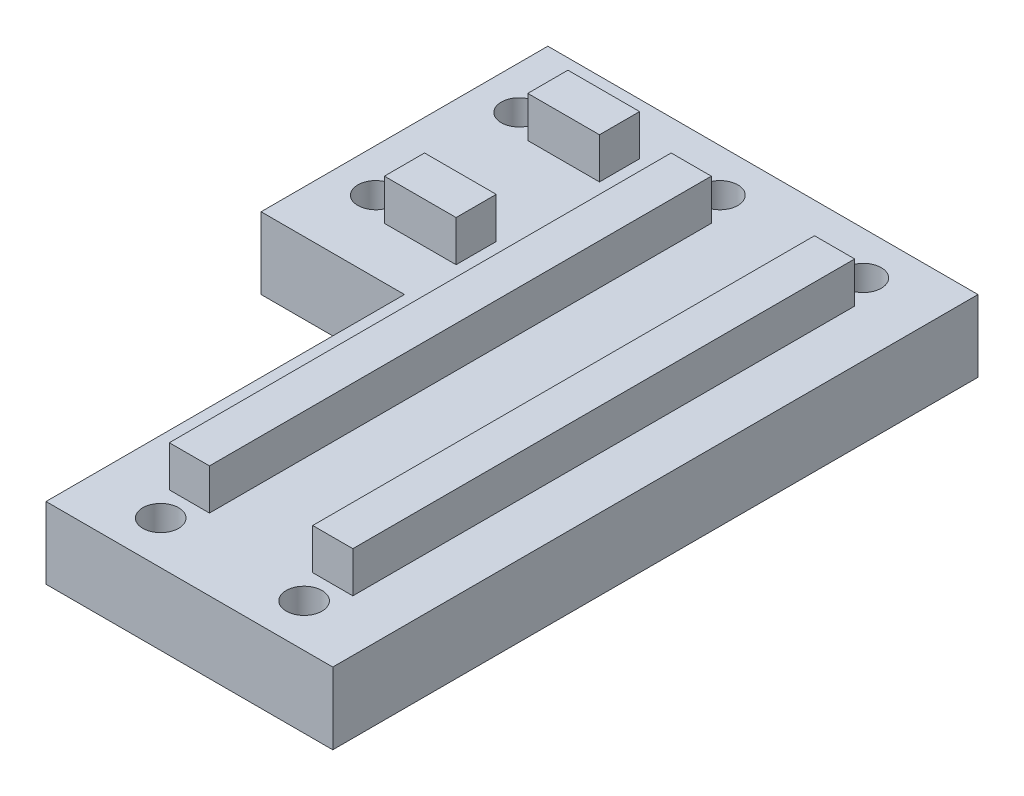
ISO-10303-21;
HEADER;
FILE_DESCRIPTION(('STEP AP214'),'2;1');
FILE_NAME('part.step','',(''),(''),'','','');
FILE_SCHEMA(('AUTOMOTIVE_DESIGN { 1 0 10303 214 1 1 1 1 }'));
ENDSEC;
DATA;
#1=APPLICATION_CONTEXT('core data for automotive mechanical design processes');
#2=APPLICATION_PROTOCOL_DEFINITION('international standard','automotive_design',2000,#1);
#3=PRODUCT_CONTEXT('',#1,'mechanical');
#4=PRODUCT('Part','Part','',(#3));
#5=PRODUCT_RELATED_PRODUCT_CATEGORY('part','',(#4));
#6=PRODUCT_DEFINITION_FORMATION('','',#4);
#7=PRODUCT_DEFINITION_CONTEXT('part definition',#1,'design');
#8=PRODUCT_DEFINITION('design','',#6,#7);
#9=PRODUCT_DEFINITION_SHAPE('','',#8);
#10=(LENGTH_UNIT() NAMED_UNIT(*) SI_UNIT(.MILLI.,.METRE.));
#11=(NAMED_UNIT(*) PLANE_ANGLE_UNIT() SI_UNIT($,.RADIAN.));
#12=(NAMED_UNIT(*) SI_UNIT($,.STERADIAN.) SOLID_ANGLE_UNIT());
#13=UNCERTAINTY_MEASURE_WITH_UNIT(LENGTH_MEASURE(1.E-05),#10,'distance_accuracy_value','');
#14=(GEOMETRIC_REPRESENTATION_CONTEXT(3) GLOBAL_UNCERTAINTY_ASSIGNED_CONTEXT((#13)) GLOBAL_UNIT_ASSIGNED_CONTEXT((#10,
#11,#12)) REPRESENTATION_CONTEXT('',''));
#15=CARTESIAN_POINT('',(0.,0.,0.));
#16=DIRECTION('',(0.,0.,1.));
#17=DIRECTION('',(1.,0.,0.));
#18=AXIS2_PLACEMENT_3D('',#15,#16,#17);
#19=CARTESIAN_POINT('',(-15.,10.,20.));
#20=DIRECTION('',(0.,0.,-1.));
#21=DIRECTION('',(-1.,0.,0.));
#22=AXIS2_PLACEMENT_3D('',#19,#20,#21);
#23=PLANE('',#22);
#24=DIRECTION('',(0.,1.,0.));
#25=VECTOR('',#24,1.);
#26=CARTESIAN_POINT('',(-35.,10.,20.));
#27=LINE('',#26,#25);
#28=CARTESIAN_POINT('',(-35.,0.,20.));
#29=VERTEX_POINT('',#28);
#30=CARTESIAN_POINT('',(-35.,10.,20.));
#31=VERTEX_POINT('',#30);
#32=EDGE_CURVE('E331',#29,#31,#27,.T.);
#33=ORIENTED_EDGE('',*,*,#32,.F.);
#34=DIRECTION('',(1.,0.,0.));
#35=VECTOR('',#34,1.);
#36=CARTESIAN_POINT('',(-15.,0.,20.));
#37=LINE('',#36,#35);
#38=CARTESIAN_POINT('',(-15.,0.,20.));
#39=VERTEX_POINT('',#38);
#40=EDGE_CURVE('E234',#29,#39,#37,.T.);
#41=ORIENTED_EDGE('',*,*,#40,.T.);
#42=DIRECTION('',(0.,-1.,0.));
#43=VECTOR('',#42,1.);
#44=CARTESIAN_POINT('',(-15.,10.,20.));
#45=LINE('',#44,#43);
#46=CARTESIAN_POINT('',(-15.,10.,20.));
#47=VERTEX_POINT('',#46);
#48=EDGE_CURVE('E267',#47,#39,#45,.T.);
#49=ORIENTED_EDGE('',*,*,#48,.F.);
#50=DIRECTION('',(1.,0.,0.));
#51=VECTOR('',#50,1.);
#52=CARTESIAN_POINT('',(-15.,10.,20.));
#53=LINE('',#52,#51);
#54=EDGE_CURVE('E237',#31,#47,#53,.T.);
#55=ORIENTED_EDGE('',*,*,#54,.F.);
#56=EDGE_LOOP('',(#33,#41,#49,#55));
#57=FACE_BOUND('',#56,.T.);
#58=ADVANCED_FACE('F34',(#57),#23,.F.);
#59=CARTESIAN_POINT('',(25.,10.,-20.));
#60=DIRECTION('',(0.,0.,1.));
#61=DIRECTION('',(1.,0.,0.));
#62=AXIS2_PLACEMENT_3D('',#59,#60,#61);
#63=PLANE('',#62);
#64=DIRECTION('',(0.,-1.,0.));
#65=VECTOR('',#64,1.);
#66=CARTESIAN_POINT('',(-35.,10.,-20.));
#67=LINE('',#66,#65);
#68=CARTESIAN_POINT('',(-35.,10.,-20.));
#69=VERTEX_POINT('',#68);
#70=CARTESIAN_POINT('',(-35.,0.,-20.));
#71=VERTEX_POINT('',#70);
#72=EDGE_CURVE('E326',#69,#71,#67,.T.);
#73=ORIENTED_EDGE('',*,*,#72,.F.);
#74=DIRECTION('',(-1.,0.,0.));
#75=VECTOR('',#74,1.);
#76=CARTESIAN_POINT('',(25.,10.,-20.));
#77=LINE('',#76,#75);
#78=CARTESIAN_POINT('',(25.,10.,-20.));
#79=VERTEX_POINT('',#78);
#80=EDGE_CURVE('E246',#79,#69,#77,.T.);
#81=ORIENTED_EDGE('',*,*,#80,.F.);
#82=DIRECTION('',(0.,-1.,0.));
#83=VECTOR('',#82,1.);
#84=CARTESIAN_POINT('',(25.,10.,-20.));
#85=LINE('',#84,#83);
#86=CARTESIAN_POINT('',(25.,0.,-20.));
#87=VERTEX_POINT('',#86);
#88=EDGE_CURVE('E248',#79,#87,#85,.T.);
#89=ORIENTED_EDGE('',*,*,#88,.T.);
#90=DIRECTION('',(-1.,0.,0.));
#91=VECTOR('',#90,1.);
#92=CARTESIAN_POINT('',(25.,0.,-20.));
#93=LINE('',#92,#91);
#94=EDGE_CURVE('E240',#87,#71,#93,.T.);
#95=ORIENTED_EDGE('',*,*,#94,.T.);
#96=EDGE_LOOP('',(#73,#81,#89,#95));
#97=FACE_BOUND('',#96,.T.);
#98=ADVANCED_FACE('F389',(#97),#63,.F.);
#99=CARTESIAN_POINT('',(0.,0.,0.));
#100=DIRECTION('',(0.,-1.,0.));
#101=DIRECTION('',(0.,0.,-1.));
#102=AXIS2_PLACEMENT_3D('',#99,#100,#101);
#103=PLANE('',#102);
#104=CARTESIAN_POINT('',(-5.,0.,64.));
#105=DIRECTION('',(0.,1.,0.));
#106=DIRECTION('',(0.,0.,1.));
#107=AXIS2_PLACEMENT_3D('',#104,#105,#106);
#108=CIRCLE('',#107,2.5);
#109=CARTESIAN_POINT('',(-5.,0.,66.5));
#110=VERTEX_POINT('',#109);
#111=EDGE_CURVE('E501',#110,#110,#108,.T.);
#112=ORIENTED_EDGE('',*,*,#111,.T.);
#113=EDGE_LOOP('',(#112));
#114=FACE_BOUND('',#113,.T.);
#115=CARTESIAN_POINT('',(-4.99999999999999,0.,-14.));
#116=DIRECTION('',(0.,1.,0.));
#117=DIRECTION('',(0.,0.,1.));
#118=AXIS2_PLACEMENT_3D('',#115,#116,#117);
#119=CIRCLE('',#118,2.5);
#120=CARTESIAN_POINT('',(-4.99999999999999,0.,-11.5));
#121=VERTEX_POINT('',#120);
#122=EDGE_CURVE('E490',#121,#121,#119,.T.);
#123=ORIENTED_EDGE('',*,*,#122,.T.);
#124=EDGE_LOOP('',(#123));
#125=FACE_BOUND('',#124,.T.);
#126=CARTESIAN_POINT('',(15.,0.,-14.));
#127=DIRECTION('',(0.,1.,0.));
#128=DIRECTION('',(0.,0.,1.));
#129=AXIS2_PLACEMENT_3D('',#126,#127,#128);
#130=CIRCLE('',#129,2.5);
#131=CARTESIAN_POINT('',(15.,0.,-11.5));
#132=VERTEX_POINT('',#131);
#133=EDGE_CURVE('E489',#132,#132,#130,.T.);
#134=ORIENTED_EDGE('',*,*,#133,.T.);
#135=EDGE_LOOP('',(#134));
#136=FACE_BOUND('',#135,.T.);
#137=CARTESIAN_POINT('',(-29.,0.,9.99999999999999));
#138=DIRECTION('',(0.,1.,0.));
#139=DIRECTION('',(0.,0.,1.));
#140=AXIS2_PLACEMENT_3D('',#137,#138,#139);
#141=CIRCLE('',#140,2.5);
#142=CARTESIAN_POINT('',(-29.,0.,12.5));
#143=VERTEX_POINT('',#142);
#144=EDGE_CURVE('E483',#143,#143,#141,.T.);
#145=ORIENTED_EDGE('',*,*,#144,.T.);
#146=EDGE_LOOP('',(#145));
#147=FACE_BOUND('',#146,.T.);
#148=CARTESIAN_POINT('',(15.,0.,64.));
#149=DIRECTION('',(0.,1.,0.));
#150=DIRECTION('',(0.,0.,1.));
#151=AXIS2_PLACEMENT_3D('',#148,#149,#150);
#152=CIRCLE('',#151,2.5);
#153=CARTESIAN_POINT('',(15.,0.,66.5));
#154=VERTEX_POINT('',#153);
#155=EDGE_CURVE('E502',#154,#154,#152,.T.);
#156=ORIENTED_EDGE('',*,*,#155,.T.);
#157=EDGE_LOOP('',(#156));
#158=FACE_BOUND('',#157,.T.);
#159=CARTESIAN_POINT('',(-29.,0.,-10.));
#160=DIRECTION('',(0.,1.,0.));
#161=DIRECTION('',(0.,0.,1.));
#162=AXIS2_PLACEMENT_3D('',#159,#160,#161);
#163=CIRCLE('',#162,2.5);
#164=CARTESIAN_POINT('',(-29.,0.,-7.50000000000001));
#165=VERTEX_POINT('',#164);
#166=EDGE_CURVE('E306',#165,#165,#163,.T.);
#167=ORIENTED_EDGE('',*,*,#166,.T.);
#168=EDGE_LOOP('',(#167));
#169=FACE_BOUND('',#168,.T.);
#170=ORIENTED_EDGE('',*,*,#40,.F.);
#171=DIRECTION('',(0.,0.,-1.));
#172=VECTOR('',#171,1.);
#173=CARTESIAN_POINT('',(-35.,0.,0.));
#174=LINE('',#173,#172);
#175=EDGE_CURVE('E328',#29,#71,#174,.T.);
#176=ORIENTED_EDGE('',*,*,#175,.T.);
#177=ORIENTED_EDGE('',*,*,#94,.F.);
#178=DIRECTION('',(0.,0.,-1.));
#179=VECTOR('',#178,1.);
#180=CARTESIAN_POINT('',(25.,0.,-20.));
#181=LINE('',#180,#179);
#182=CARTESIAN_POINT('',(25.,0.,70.));
#183=VERTEX_POINT('',#182);
#184=EDGE_CURVE('E255',#183,#87,#181,.T.);
#185=ORIENTED_EDGE('',*,*,#184,.F.);
#186=DIRECTION('',(1.,0.,0.));
#187=VECTOR('',#186,1.);
#188=CARTESIAN_POINT('',(25.,0.,70.));
#189=LINE('',#188,#187);
#190=CARTESIAN_POINT('',(-15.,0.,70.));
#191=VERTEX_POINT('',#190);
#192=EDGE_CURVE('E252',#191,#183,#189,.T.);
#193=ORIENTED_EDGE('',*,*,#192,.F.);
#194=DIRECTION('',(0.,0.,1.));
#195=VECTOR('',#194,1.);
#196=CARTESIAN_POINT('',(-15.,0.,20.));
#197=LINE('',#196,#195);
#198=EDGE_CURVE('E250',#39,#191,#197,.T.);
#199=ORIENTED_EDGE('',*,*,#198,.F.);
#200=EDGE_LOOP('',(#170,#176,#177,#185,#193,#199));
#201=FACE_BOUND('',#200,.T.);
#202=ADVANCED_FACE('F394',(#114,#125,#136,#147,#158,#169,#201),#103,.T.);
#203=CARTESIAN_POINT('',(-15.,10.,7.19999999999998));
#204=DIRECTION('',(0.,0.,-1.));
#205=DIRECTION('',(-1.,0.,0.));
#206=AXIS2_PLACEMENT_3D('',#203,#204,#205);
#207=PLANE('',#206);
#208=DIRECTION('',(0.,-1.,0.));
#209=VECTOR('',#208,1.);
#210=CARTESIAN_POINT('',(-25.,10.,7.19999999999998));
#211=LINE('',#210,#209);
#212=CARTESIAN_POINT('',(-25.,15.6999999999998,7.19999999999998));
#213=VERTEX_POINT('',#212);
#214=CARTESIAN_POINT('',(-25.,10.,7.19999999999998));
#215=VERTEX_POINT('',#214);
#216=EDGE_CURVE('E191',#213,#215,#211,.T.);
#217=ORIENTED_EDGE('',*,*,#216,.F.);
#218=DIRECTION('',(-1.,0.,0.));
#219=VECTOR('',#218,1.);
#220=CARTESIAN_POINT('',(-15.,15.6999999999998,7.19999999999998));
#221=LINE('',#220,#219);
#222=CARTESIAN_POINT('',(-15.,15.6999999999998,7.19999999999998));
#223=VERTEX_POINT('',#222);
#224=EDGE_CURVE('E200',#223,#213,#221,.T.);
#225=ORIENTED_EDGE('',*,*,#224,.F.);
#226=DIRECTION('',(0.,-1.,0.));
#227=VECTOR('',#226,1.);
#228=CARTESIAN_POINT('',(-15.,10.,7.19999999999998));
#229=LINE('',#228,#227);
#230=CARTESIAN_POINT('',(-15.,10.,7.19999999999998));
#231=VERTEX_POINT('',#230);
#232=EDGE_CURVE('E348',#223,#231,#229,.T.);
#233=ORIENTED_EDGE('',*,*,#232,.T.);
#234=DIRECTION('',(-1.,0.,0.));
#235=VECTOR('',#234,1.);
#236=CARTESIAN_POINT('',(-15.,10.,7.19999999999998));
#237=LINE('',#236,#235);
#238=EDGE_CURVE('E212',#231,#215,#237,.T.);
#239=ORIENTED_EDGE('',*,*,#238,.T.);
#240=EDGE_LOOP('',(#217,#225,#233,#239));
#241=FACE_BOUND('',#240,.T.);
#242=ADVANCED_FACE('F366',(#241),#207,.T.);
#243=CARTESIAN_POINT('',(-15.,15.6999999999998,7.19999999999998));
#244=DIRECTION('',(0.,1.,0.));
#245=DIRECTION('',(0.,0.,1.));
#246=AXIS2_PLACEMENT_3D('',#243,#244,#245);
#247=PLANE('',#246);
#248=DIRECTION('',(0.,0.,-1.));
#249=VECTOR('',#248,1.);
#250=CARTESIAN_POINT('',(-25.,15.6999999999998,-20.));
#251=LINE('',#250,#249);
#252=CARTESIAN_POINT('',(-25.,15.6999999999998,12.8));
#253=VERTEX_POINT('',#252);
#254=EDGE_CURVE('E183',#253,#213,#251,.T.);
#255=ORIENTED_EDGE('',*,*,#254,.F.);
#256=DIRECTION('',(-1.,0.,0.));
#257=VECTOR('',#256,1.);
#258=CARTESIAN_POINT('',(-15.,15.6999999999998,12.8));
#259=LINE('',#258,#257);
#260=CARTESIAN_POINT('',(-15.,15.6999999999998,12.8));
#261=VERTEX_POINT('',#260);
#262=EDGE_CURVE('E198',#261,#253,#259,.T.);
#263=ORIENTED_EDGE('',*,*,#262,.F.);
#264=DIRECTION('',(0.,0.,-1.));
#265=VECTOR('',#264,1.);
#266=CARTESIAN_POINT('',(-15.,15.6999999999998,7.19999999999998));
#267=LINE('',#266,#265);
#268=EDGE_CURVE('E218',#261,#223,#267,.T.);
#269=ORIENTED_EDGE('',*,*,#268,.T.);
#270=ORIENTED_EDGE('',*,*,#224,.T.);
#271=EDGE_LOOP('',(#255,#263,#269,#270));
#272=FACE_BOUND('',#271,.T.);
#273=ADVANCED_FACE('F196',(#272),#247,.T.);
#274=CARTESIAN_POINT('',(-15.,15.6999999999998,12.8));
#275=DIRECTION('',(0.,0.,1.));
#276=DIRECTION('',(1.,0.,0.));
#277=AXIS2_PLACEMENT_3D('',#274,#275,#276);
#278=PLANE('',#277);
#279=DIRECTION('',(0.,1.,0.));
#280=VECTOR('',#279,1.);
#281=CARTESIAN_POINT('',(-25.,15.6999999999998,12.8));
#282=LINE('',#281,#280);
#283=CARTESIAN_POINT('',(-25.,10.,12.8));
#284=VERTEX_POINT('',#283);
#285=EDGE_CURVE('E180',#284,#253,#282,.T.);
#286=ORIENTED_EDGE('',*,*,#285,.F.);
#287=DIRECTION('',(-1.,0.,0.));
#288=VECTOR('',#287,1.);
#289=CARTESIAN_POINT('',(-15.,10.,12.8));
#290=LINE('',#289,#288);
#291=CARTESIAN_POINT('',(-15.,10.,12.8));
#292=VERTEX_POINT('',#291);
#293=EDGE_CURVE('E208',#292,#284,#290,.T.);
#294=ORIENTED_EDGE('',*,*,#293,.F.);
#295=DIRECTION('',(0.,1.,0.));
#296=VECTOR('',#295,1.);
#297=CARTESIAN_POINT('',(-15.,15.6999999999998,12.8));
#298=LINE('',#297,#296);
#299=EDGE_CURVE('E206',#292,#261,#298,.T.);
#300=ORIENTED_EDGE('',*,*,#299,.T.);
#301=ORIENTED_EDGE('',*,*,#262,.T.);
#302=EDGE_LOOP('',(#286,#294,#300,#301));
#303=FACE_BOUND('',#302,.T.);
#304=ADVANCED_FACE('F204',(#303),#278,.T.);
#305=CARTESIAN_POINT('',(-15.,9.99999999999986,-12.8));
#306=DIRECTION('',(0.,0.,-1.));
#307=DIRECTION('',(-1.,0.,0.));
#308=AXIS2_PLACEMENT_3D('',#305,#306,#307);
#309=PLANE('',#308);
#310=DIRECTION('',(0.,-1.,0.));
#311=VECTOR('',#310,1.);
#312=CARTESIAN_POINT('',(-25.,9.99999999999986,-12.8));
#313=LINE('',#312,#311);
#314=CARTESIAN_POINT('',(-25.,15.6999999999998,-12.8));
#315=VERTEX_POINT('',#314);
#316=CARTESIAN_POINT('',(-25.,10.,-12.8));
#317=VERTEX_POINT('',#316);
#318=EDGE_CURVE('E192',#315,#317,#313,.T.);
#319=ORIENTED_EDGE('',*,*,#318,.F.);
#320=DIRECTION('',(-1.,0.,0.));
#321=VECTOR('',#320,1.);
#322=CARTESIAN_POINT('',(-15.,15.6999999999996,-12.8));
#323=LINE('',#322,#321);
#324=CARTESIAN_POINT('',(-15.,15.6999999999996,-12.8));
#325=VERTEX_POINT('',#324);
#326=EDGE_CURVE('E345',#325,#315,#323,.T.);
#327=ORIENTED_EDGE('',*,*,#326,.F.);
#328=DIRECTION('',(0.,-1.,0.));
#329=VECTOR('',#328,1.);
#330=CARTESIAN_POINT('',(-15.,9.99999999999986,-12.8));
#331=LINE('',#330,#329);
#332=CARTESIAN_POINT('',(-15.,10.,-12.8));
#333=VERTEX_POINT('',#332);
#334=EDGE_CURVE('E334',#325,#333,#331,.T.);
#335=ORIENTED_EDGE('',*,*,#334,.T.);
#336=DIRECTION('',(-1.,0.,0.));
#337=VECTOR('',#336,1.);
#338=CARTESIAN_POINT('',(-15.,9.99999999999986,-12.8));
#339=LINE('',#338,#337);
#340=EDGE_CURVE('E344',#333,#317,#339,.T.);
#341=ORIENTED_EDGE('',*,*,#340,.T.);
#342=EDGE_LOOP('',(#319,#327,#335,#341));
#343=FACE_BOUND('',#342,.T.);
#344=ADVANCED_FACE('F437',(#343),#309,.T.);
#345=CARTESIAN_POINT('',(-15.,15.6999999999996,-12.8));
#346=DIRECTION('',(0.,1.,0.));
#347=DIRECTION('',(0.,0.,1.));
#348=AXIS2_PLACEMENT_3D('',#345,#346,#347);
#349=PLANE('',#348);
#350=CARTESIAN_POINT('',(-25.,15.6999999999998,-7.20000000000002));
#351=VERTEX_POINT('',#350);
#352=EDGE_CURVE('E202',#351,#315,#251,.T.);
#353=ORIENTED_EDGE('',*,*,#352,.F.);
#354=DIRECTION('',(-1.,0.,0.));
#355=VECTOR('',#354,1.);
#356=CARTESIAN_POINT('',(-15.,15.6999999999996,-7.20000000000003));
#357=LINE('',#356,#355);
#358=CARTESIAN_POINT('',(-15.,15.6999999999996,-7.20000000000003));
#359=VERTEX_POINT('',#358);
#360=EDGE_CURVE('E349',#359,#351,#357,.T.);
#361=ORIENTED_EDGE('',*,*,#360,.F.);
#362=DIRECTION('',(0.,0.,-1.));
#363=VECTOR('',#362,1.);
#364=CARTESIAN_POINT('',(-15.,15.6999999999996,-12.8));
#365=LINE('',#364,#363);
#366=EDGE_CURVE('E342',#359,#325,#365,.T.);
#367=ORIENTED_EDGE('',*,*,#366,.T.);
#368=ORIENTED_EDGE('',*,*,#326,.T.);
#369=EDGE_LOOP('',(#353,#361,#367,#368));
#370=FACE_BOUND('',#369,.T.);
#371=ADVANCED_FACE('F433',(#370),#349,.T.);
#372=CARTESIAN_POINT('',(-15.,15.6999999999996,-7.20000000000003));
#373=DIRECTION('',(0.,0.,1.));
#374=DIRECTION('',(1.,0.,0.));
#375=AXIS2_PLACEMENT_3D('',#372,#373,#374);
#376=PLANE('',#375);
#377=DIRECTION('',(0.,1.,0.));
#378=VECTOR('',#377,1.);
#379=CARTESIAN_POINT('',(-25.,15.6999999999996,-7.20000000000002));
#380=LINE('',#379,#378);
#381=CARTESIAN_POINT('',(-25.,10.,-7.20000000000002));
#382=VERTEX_POINT('',#381);
#383=EDGE_CURVE('E11',#382,#351,#380,.T.);
#384=ORIENTED_EDGE('',*,*,#383,.F.);
#385=DIRECTION('',(-1.,0.,0.));
#386=VECTOR('',#385,1.);
#387=CARTESIAN_POINT('',(-15.,9.99999999999986,-7.20000000000003));
#388=LINE('',#387,#386);
#389=CARTESIAN_POINT('',(-15.,10.,-7.20000000000003));
#390=VERTEX_POINT('',#389);
#391=EDGE_CURVE('E352',#390,#382,#388,.T.);
#392=ORIENTED_EDGE('',*,*,#391,.F.);
#393=DIRECTION('',(0.,1.,0.));
#394=VECTOR('',#393,1.);
#395=CARTESIAN_POINT('',(-15.,15.6999999999996,-7.20000000000003));
#396=LINE('',#395,#394);
#397=EDGE_CURVE('E339',#390,#359,#396,.T.);
#398=ORIENTED_EDGE('',*,*,#397,.T.);
#399=ORIENTED_EDGE('',*,*,#360,.T.);
#400=EDGE_LOOP('',(#384,#392,#398,#399));
#401=FACE_BOUND('',#400,.T.);
#402=ADVANCED_FACE('F436',(#401),#376,.T.);
#403=CARTESIAN_POINT('',(-15.,10.,20.));
#404=DIRECTION('',(1.,0.,0.));
#405=DIRECTION('',(0.,0.,-1.));
#406=AXIS2_PLACEMENT_3D('',#403,#404,#405);
#407=PLANE('',#406);
#408=ORIENTED_EDGE('',*,*,#198,.T.);
#409=DIRECTION('',(0.,-1.,0.));
#410=VECTOR('',#409,1.);
#411=CARTESIAN_POINT('',(-15.,10.,70.));
#412=LINE('',#411,#410);
#413=CARTESIAN_POINT('',(-15.,10.,70.));
#414=VERTEX_POINT('',#413);
#415=EDGE_CURVE('E264',#414,#191,#412,.T.);
#416=ORIENTED_EDGE('',*,*,#415,.F.);
#417=DIRECTION('',(0.,0.,1.));
#418=VECTOR('',#417,1.);
#419=CARTESIAN_POINT('',(-15.,10.,20.));
#420=LINE('',#419,#418);
#421=EDGE_CURVE('E239',#47,#414,#420,.T.);
#422=ORIENTED_EDGE('',*,*,#421,.F.);
#423=ORIENTED_EDGE('',*,*,#48,.T.);
#424=EDGE_LOOP('',(#408,#416,#422,#423));
#425=FACE_BOUND('',#424,.T.);
#426=ADVANCED_FACE('F408',(#425),#407,.F.);
#427=CARTESIAN_POINT('',(25.,10.,70.));
#428=DIRECTION('',(0.,0.,-1.));
#429=DIRECTION('',(-1.,0.,0.));
#430=AXIS2_PLACEMENT_3D('',#427,#428,#429);
#431=PLANE('',#430);
#432=DIRECTION('',(0.,-1.,0.));
#433=VECTOR('',#432,1.);
#434=CARTESIAN_POINT('',(25.,10.,70.));
#435=LINE('',#434,#433);
#436=CARTESIAN_POINT('',(25.,10.,70.));
#437=VERTEX_POINT('',#436);
#438=EDGE_CURVE('E261',#437,#183,#435,.T.);
#439=ORIENTED_EDGE('',*,*,#438,.F.);
#440=DIRECTION('',(1.,0.,0.));
#441=VECTOR('',#440,1.);
#442=CARTESIAN_POINT('',(25.,10.,70.));
#443=LINE('',#442,#441);
#444=EDGE_CURVE('E242',#414,#437,#443,.T.);
#445=ORIENTED_EDGE('',*,*,#444,.F.);
#446=ORIENTED_EDGE('',*,*,#415,.T.);
#447=ORIENTED_EDGE('',*,*,#192,.T.);
#448=EDGE_LOOP('',(#439,#445,#446,#447));
#449=FACE_BOUND('',#448,.T.);
#450=ADVANCED_FACE('F381',(#449),#431,.F.);
#451=CARTESIAN_POINT('',(25.,10.,-20.));
#452=DIRECTION('',(-1.,0.,0.));
#453=DIRECTION('',(0.,0.,1.));
#454=AXIS2_PLACEMENT_3D('',#451,#452,#453);
#455=PLANE('',#454);
#456=ORIENTED_EDGE('',*,*,#184,.T.);
#457=ORIENTED_EDGE('',*,*,#88,.F.);
#458=DIRECTION('',(0.,0.,-1.));
#459=VECTOR('',#458,1.);
#460=CARTESIAN_POINT('',(25.,10.,20.));
#461=LINE('',#460,#459);
#462=EDGE_CURVE('E244',#437,#79,#461,.T.);
#463=ORIENTED_EDGE('',*,*,#462,.F.);
#464=ORIENTED_EDGE('',*,*,#438,.T.);
#465=EDGE_LOOP('',(#456,#457,#463,#464));
#466=FACE_BOUND('',#465,.T.);
#467=ADVANCED_FACE('F371',(#466),#455,.F.);
#468=CARTESIAN_POINT('',(0.,10.,0.));
#469=DIRECTION('',(0.,-1.,0.));
#470=DIRECTION('',(0.,0.,-1.));
#471=AXIS2_PLACEMENT_3D('',#468,#469,#470);
#472=PLANE('',#471);
#473=CARTESIAN_POINT('',(-5.,10.,64.));
#474=DIRECTION('',(0.,1.,0.));
#475=DIRECTION('',(0.,0.,1.));
#476=AXIS2_PLACEMENT_3D('',#473,#474,#475);
#477=CIRCLE('',#476,2.5);
#478=CARTESIAN_POINT('',(-5.,10.,66.5));
#479=VERTEX_POINT('',#478);
#480=EDGE_CURVE('E498',#479,#479,#477,.T.);
#481=ORIENTED_EDGE('',*,*,#480,.F.);
#482=EDGE_LOOP('',(#481));
#483=FACE_BOUND('',#482,.T.);
#484=CARTESIAN_POINT('',(-4.99999999999999,10.,-14.));
#485=DIRECTION('',(0.,1.,0.));
#486=DIRECTION('',(0.,0.,1.));
#487=AXIS2_PLACEMENT_3D('',#484,#485,#486);
#488=CIRCLE('',#487,2.5);
#489=CARTESIAN_POINT('',(-4.99999999999999,10.,-11.5));
#490=VERTEX_POINT('',#489);
#491=EDGE_CURVE('E505',#490,#490,#488,.T.);
#492=ORIENTED_EDGE('',*,*,#491,.F.);
#493=EDGE_LOOP('',(#492));
#494=FACE_BOUND('',#493,.T.);
#495=CARTESIAN_POINT('',(15.,10.,-14.));
#496=DIRECTION('',(0.,1.,0.));
#497=DIRECTION('',(0.,0.,1.));
#498=AXIS2_PLACEMENT_3D('',#495,#496,#497);
#499=CIRCLE('',#498,2.5);
#500=CARTESIAN_POINT('',(15.,10.,-11.5));
#501=VERTEX_POINT('',#500);
#502=EDGE_CURVE('E486',#501,#501,#499,.T.);
#503=ORIENTED_EDGE('',*,*,#502,.F.);
#504=EDGE_LOOP('',(#503));
#505=FACE_BOUND('',#504,.T.);
#506=CARTESIAN_POINT('',(-29.,10.,9.99999999999999));
#507=DIRECTION('',(0.,1.,0.));
#508=DIRECTION('',(0.,0.,1.));
#509=AXIS2_PLACEMENT_3D('',#506,#507,#508);
#510=CIRCLE('',#509,2.5);
#511=CARTESIAN_POINT('',(-29.,10.,12.5));
#512=VERTEX_POINT('',#511);
#513=EDGE_CURVE('E493',#512,#512,#510,.T.);
#514=ORIENTED_EDGE('',*,*,#513,.F.);
#515=EDGE_LOOP('',(#514));
#516=FACE_BOUND('',#515,.T.);
#517=CARTESIAN_POINT('',(15.,10.,64.));
#518=DIRECTION('',(0.,1.,0.));
#519=DIRECTION('',(0.,0.,1.));
#520=AXIS2_PLACEMENT_3D('',#517,#518,#519);
#521=CIRCLE('',#520,2.5);
#522=CARTESIAN_POINT('',(15.,10.,66.5));
#523=VERTEX_POINT('',#522);
#524=EDGE_CURVE('E510',#523,#523,#521,.T.);
#525=ORIENTED_EDGE('',*,*,#524,.F.);
#526=EDGE_LOOP('',(#525));
#527=FACE_BOUND('',#526,.T.);
#528=CARTESIAN_POINT('',(-29.,10.,-10.));
#529=DIRECTION('',(0.,1.,0.));
#530=DIRECTION('',(0.,0.,1.));
#531=AXIS2_PLACEMENT_3D('',#528,#529,#530);
#532=CIRCLE('',#531,2.5);
#533=CARTESIAN_POINT('',(-29.,10.,-7.50000000000001));
#534=VERTEX_POINT('',#533);
#535=EDGE_CURVE('E480',#534,#534,#532,.T.);
#536=ORIENTED_EDGE('',*,*,#535,.F.);
#537=EDGE_LOOP('',(#536));
#538=FACE_BOUND('',#537,.T.);
#539=DIRECTION('',(-1.,0.,0.));
#540=VECTOR('',#539,1.);
#541=CARTESIAN_POINT('',(-15.,10.,60.));
#542=LINE('',#541,#540);
#543=CARTESIAN_POINT('',(-2.19999999999998,10.,60.));
#544=VERTEX_POINT('',#543);
#545=CARTESIAN_POINT('',(-7.79999999999998,10.,60.));
#546=VERTEX_POINT('',#545);
#547=EDGE_CURVE('E303',#544,#546,#542,.T.);
#548=ORIENTED_EDGE('',*,*,#547,.T.);
#549=DIRECTION('',(0.,0.,-1.));
#550=VECTOR('',#549,1.);
#551=CARTESIAN_POINT('',(-7.79999999999998,10.,0.));
#552=LINE('',#551,#550);
#553=CARTESIAN_POINT('',(-7.79999999999998,10.,-10.));
#554=VERTEX_POINT('',#553);
#555=EDGE_CURVE('E227',#546,#554,#552,.T.);
#556=ORIENTED_EDGE('',*,*,#555,.T.);
#557=DIRECTION('',(1.,0.,0.));
#558=VECTOR('',#557,1.);
#559=CARTESIAN_POINT('',(25.,10.,-10.));
#560=LINE('',#559,#558);
#561=CARTESIAN_POINT('',(-2.19999999999998,10.,-10.));
#562=VERTEX_POINT('',#561);
#563=EDGE_CURVE('E300',#554,#562,#560,.T.);
#564=ORIENTED_EDGE('',*,*,#563,.T.);
#565=DIRECTION('',(0.,0.,1.));
#566=VECTOR('',#565,1.);
#567=CARTESIAN_POINT('',(-2.19999999999998,10.,0.));
#568=LINE('',#567,#566);
#569=EDGE_CURVE('E222',#562,#544,#568,.T.);
#570=ORIENTED_EDGE('',*,*,#569,.T.);
#571=EDGE_LOOP('',(#548,#556,#564,#570));
#572=FACE_BOUND('',#571,.T.);
#573=ORIENTED_EDGE('',*,*,#80,.T.);
#574=DIRECTION('',(0.,0.,-1.));
#575=VECTOR('',#574,1.);
#576=CARTESIAN_POINT('',(-35.,10.,0.));
#577=LINE('',#576,#575);
#578=EDGE_CURVE('E323',#31,#69,#577,.T.);
#579=ORIENTED_EDGE('',*,*,#578,.F.);
#580=ORIENTED_EDGE('',*,*,#54,.T.);
#581=ORIENTED_EDGE('',*,*,#421,.T.);
#582=ORIENTED_EDGE('',*,*,#444,.T.);
#583=ORIENTED_EDGE('',*,*,#462,.T.);
#584=EDGE_LOOP('',(#573,#579,#580,#581,#582,#583));
#585=FACE_BOUND('',#584,.T.);
#586=CARTESIAN_POINT('',(17.8,10.,60.));
#587=VERTEX_POINT('',#586);
#588=CARTESIAN_POINT('',(12.2,10.,60.));
#589=VERTEX_POINT('',#588);
#590=EDGE_CURVE('E312',#587,#589,#542,.T.);
#591=ORIENTED_EDGE('',*,*,#590,.T.);
#592=DIRECTION('',(0.,0.,-1.));
#593=VECTOR('',#592,1.);
#594=CARTESIAN_POINT('',(12.2,10.,0.));
#595=LINE('',#594,#593);
#596=CARTESIAN_POINT('',(12.2,10.,-10.));
#597=VERTEX_POINT('',#596);
#598=EDGE_CURVE('E273',#589,#597,#595,.T.);
#599=ORIENTED_EDGE('',*,*,#598,.T.);
#600=CARTESIAN_POINT('',(17.8,10.,-10.));
#601=VERTEX_POINT('',#600);
#602=EDGE_CURVE('E296',#597,#601,#560,.T.);
#603=ORIENTED_EDGE('',*,*,#602,.T.);
#604=DIRECTION('',(0.,0.,1.));
#605=VECTOR('',#604,1.);
#606=CARTESIAN_POINT('',(17.8,10.,0.));
#607=LINE('',#606,#605);
#608=EDGE_CURVE('E270',#601,#587,#607,.T.);
#609=ORIENTED_EDGE('',*,*,#608,.T.);
#610=EDGE_LOOP('',(#591,#599,#603,#609));
#611=FACE_BOUND('',#610,.T.);
#612=ORIENTED_EDGE('',*,*,#340,.F.);
#613=DIRECTION('',(0.,0.,1.));
#614=VECTOR('',#613,1.);
#615=CARTESIAN_POINT('',(-15.,9.99999999999986,-10.));
#616=LINE('',#615,#614);
#617=EDGE_CURVE('E337',#333,#390,#616,.T.);
#618=ORIENTED_EDGE('',*,*,#617,.T.);
#619=ORIENTED_EDGE('',*,*,#391,.T.);
#620=DIRECTION('',(0.,0.,-1.));
#621=VECTOR('',#620,1.);
#622=CARTESIAN_POINT('',(-25.,10.,-20.));
#623=LINE('',#622,#621);
#624=EDGE_CURVE('E201',#382,#317,#623,.T.);
#625=ORIENTED_EDGE('',*,*,#624,.T.);
#626=EDGE_LOOP('',(#612,#618,#619,#625));
#627=FACE_BOUND('',#626,.T.);
#628=EDGE_CURVE('E186',#284,#215,#623,.T.);
#629=ORIENTED_EDGE('',*,*,#628,.T.);
#630=ORIENTED_EDGE('',*,*,#238,.F.);
#631=DIRECTION('',(0.,0.,1.));
#632=VECTOR('',#631,1.);
#633=CARTESIAN_POINT('',(-15.,10.,9.99999999999998));
#634=LINE('',#633,#632);
#635=EDGE_CURVE('E359',#231,#292,#634,.T.);
#636=ORIENTED_EDGE('',*,*,#635,.T.);
#637=ORIENTED_EDGE('',*,*,#293,.T.);
#638=EDGE_LOOP('',(#629,#630,#636,#637));
#639=FACE_BOUND('',#638,.T.);
#640=ADVANCED_FACE('F368',(#483,#494,#505,#516,#527,#538,#572,#585,#611,#627,#639),#472,.F.);
#641=CARTESIAN_POINT('',(12.2,9.98737657879677,-20.));
#642=DIRECTION('',(-1.,0.,0.));
#643=DIRECTION('',(0.,0.,1.));
#644=AXIS2_PLACEMENT_3D('',#641,#642,#643);
#645=PLANE('',#644);
#646=DIRECTION('',(0.,-1.,0.));
#647=VECTOR('',#646,1.);
#648=CARTESIAN_POINT('',(12.2,9.98737657879677,60.));
#649=LINE('',#648,#647);
#650=CARTESIAN_POINT('',(12.2,15.6999999999998,60.));
#651=VERTEX_POINT('',#650);
#652=EDGE_CURVE('E319',#651,#589,#649,.T.);
#653=ORIENTED_EDGE('',*,*,#652,.F.);
#654=DIRECTION('',(0.,0.,1.));
#655=VECTOR('',#654,1.);
#656=CARTESIAN_POINT('',(12.2,15.6999999999998,-20.));
#657=LINE('',#656,#655);
#658=CARTESIAN_POINT('',(12.2,15.6999999999998,-10.));
#659=VERTEX_POINT('',#658);
#660=EDGE_CURVE('E231',#659,#651,#657,.T.);
#661=ORIENTED_EDGE('',*,*,#660,.F.);
#662=DIRECTION('',(0.,1.,0.));
#663=VECTOR('',#662,1.);
#664=CARTESIAN_POINT('',(12.2,9.98737657879677,-10.));
#665=LINE('',#664,#663);
#666=EDGE_CURVE('E48',#597,#659,#665,.T.);
#667=ORIENTED_EDGE('',*,*,#666,.F.);
#668=ORIENTED_EDGE('',*,*,#598,.F.);
#669=EDGE_LOOP('',(#653,#661,#667,#668));
#670=FACE_BOUND('',#669,.T.);
#671=ADVANCED_FACE('F370',(#670),#645,.T.);
#672=CARTESIAN_POINT('',(17.8,15.6999999999998,-20.));
#673=DIRECTION('',(1.,0.,0.));
#674=DIRECTION('',(0.,1.,0.));
#675=AXIS2_PLACEMENT_3D('',#672,#673,#674);
#676=PLANE('',#675);
#677=DIRECTION('',(0.,1.,0.));
#678=VECTOR('',#677,1.);
#679=CARTESIAN_POINT('',(17.8,15.6999999999998,60.));
#680=LINE('',#679,#678);
#681=CARTESIAN_POINT('',(17.8,15.6999999999998,60.));
#682=VERTEX_POINT('',#681);
#683=EDGE_CURVE('E56',#587,#682,#680,.T.);
#684=ORIENTED_EDGE('',*,*,#683,.F.);
#685=ORIENTED_EDGE('',*,*,#608,.F.);
#686=DIRECTION('',(0.,-1.,0.));
#687=VECTOR('',#686,1.);
#688=CARTESIAN_POINT('',(17.8,15.6999999999998,-10.));
#689=LINE('',#688,#687);
#690=CARTESIAN_POINT('',(17.8,15.6999999999998,-10.));
#691=VERTEX_POINT('',#690);
#692=EDGE_CURVE('E314',#691,#601,#689,.T.);
#693=ORIENTED_EDGE('',*,*,#692,.F.);
#694=DIRECTION('',(0.,0.,1.));
#695=VECTOR('',#694,1.);
#696=CARTESIAN_POINT('',(17.8,15.6999999999998,-20.));
#697=LINE('',#696,#695);
#698=EDGE_CURVE('E230',#691,#682,#697,.T.);
#699=ORIENTED_EDGE('',*,*,#698,.T.);
#700=EDGE_LOOP('',(#684,#685,#693,#699));
#701=FACE_BOUND('',#700,.T.);
#702=ADVANCED_FACE('F378',(#701),#676,.T.);
#703=CARTESIAN_POINT('',(12.2,15.6999999999998,-20.));
#704=DIRECTION('',(0.,1.,0.));
#705=DIRECTION('',(0.,0.,1.));
#706=AXIS2_PLACEMENT_3D('',#703,#704,#705);
#707=PLANE('',#706);
#708=DIRECTION('',(-1.,0.,0.));
#709=VECTOR('',#708,1.);
#710=CARTESIAN_POINT('',(-15.,15.6999999999998,60.));
#711=LINE('',#710,#709);
#712=EDGE_CURVE('E477',#682,#651,#711,.T.);
#713=ORIENTED_EDGE('',*,*,#712,.F.);
#714=ORIENTED_EDGE('',*,*,#698,.F.);
#715=DIRECTION('',(1.,0.,0.));
#716=VECTOR('',#715,1.);
#717=CARTESIAN_POINT('',(25.,15.6999999999998,-10.));
#718=LINE('',#717,#716);
#719=EDGE_CURVE('E297',#659,#691,#718,.T.);
#720=ORIENTED_EDGE('',*,*,#719,.F.);
#721=ORIENTED_EDGE('',*,*,#660,.T.);
#722=EDGE_LOOP('',(#713,#714,#720,#721));
#723=FACE_BOUND('',#722,.T.);
#724=ADVANCED_FACE('F456',(#723),#707,.T.);
#725=CARTESIAN_POINT('',(-7.79999999999998,9.98737657879663,-20.));
#726=DIRECTION('',(-1.,0.,0.));
#727=DIRECTION('',(0.,0.,1.));
#728=AXIS2_PLACEMENT_3D('',#725,#726,#727);
#729=PLANE('',#728);
#730=DIRECTION('',(0.,-1.,0.));
#731=VECTOR('',#730,1.);
#732=CARTESIAN_POINT('',(-7.79999999999998,9.98737657879663,60.));
#733=LINE('',#732,#731);
#734=CARTESIAN_POINT('',(-7.79999999999998,15.6999999999998,60.));
#735=VERTEX_POINT('',#734);
#736=EDGE_CURVE('E279',#735,#546,#733,.T.);
#737=ORIENTED_EDGE('',*,*,#736,.F.);
#738=DIRECTION('',(0.,0.,1.));
#739=VECTOR('',#738,1.);
#740=CARTESIAN_POINT('',(-7.79999999999998,15.6999999999996,-20.));
#741=LINE('',#740,#739);
#742=CARTESIAN_POINT('',(-7.79999999999998,15.6999999999996,-10.));
#743=VERTEX_POINT('',#742);
#744=EDGE_CURVE('E219',#743,#735,#741,.T.);
#745=ORIENTED_EDGE('',*,*,#744,.F.);
#746=DIRECTION('',(0.,1.,0.));
#747=VECTOR('',#746,1.);
#748=CARTESIAN_POINT('',(-7.79999999999998,9.98737657879663,-10.));
#749=LINE('',#748,#747);
#750=EDGE_CURVE('E311',#554,#743,#749,.T.);
#751=ORIENTED_EDGE('',*,*,#750,.F.);
#752=ORIENTED_EDGE('',*,*,#555,.F.);
#753=EDGE_LOOP('',(#737,#745,#751,#752));
#754=FACE_BOUND('',#753,.T.);
#755=ADVANCED_FACE('F288',(#754),#729,.T.);
#756=CARTESIAN_POINT('',(-2.19999999999998,15.6999999999996,-20.));
#757=DIRECTION('',(1.,0.,0.));
#758=DIRECTION('',(0.,1.,0.));
#759=AXIS2_PLACEMENT_3D('',#756,#757,#758);
#760=PLANE('',#759);
#761=DIRECTION('',(0.,1.,0.));
#762=VECTOR('',#761,1.);
#763=CARTESIAN_POINT('',(-2.19999999999998,15.6999999999996,60.));
#764=LINE('',#763,#762);
#765=CARTESIAN_POINT('',(-2.19999999999998,15.6999999999996,60.));
#766=VERTEX_POINT('',#765);
#767=EDGE_CURVE('E282',#544,#766,#764,.T.);
#768=ORIENTED_EDGE('',*,*,#767,.F.);
#769=ORIENTED_EDGE('',*,*,#569,.F.);
#770=DIRECTION('',(0.,-1.,0.));
#771=VECTOR('',#770,1.);
#772=CARTESIAN_POINT('',(-2.19999999999998,15.6999999999996,-10.));
#773=LINE('',#772,#771);
#774=CARTESIAN_POINT('',(-2.19999999999998,15.6999999999998,-10.));
#775=VERTEX_POINT('',#774);
#776=EDGE_CURVE('E309',#775,#562,#773,.T.);
#777=ORIENTED_EDGE('',*,*,#776,.F.);
#778=DIRECTION('',(0.,0.,1.));
#779=VECTOR('',#778,1.);
#780=CARTESIAN_POINT('',(-2.19999999999998,15.6999999999996,-20.));
#781=LINE('',#780,#779);
#782=EDGE_CURVE('E210',#775,#766,#781,.T.);
#783=ORIENTED_EDGE('',*,*,#782,.T.);
#784=EDGE_LOOP('',(#768,#769,#777,#783));
#785=FACE_BOUND('',#784,.T.);
#786=ADVANCED_FACE('F455',(#785),#760,.T.);
#787=CARTESIAN_POINT('',(-7.79999999999998,15.6999999999996,-20.));
#788=DIRECTION('',(0.,1.,0.));
#789=DIRECTION('',(0.,0.,1.));
#790=AXIS2_PLACEMENT_3D('',#787,#788,#789);
#791=PLANE('',#790);
#792=DIRECTION('',(-1.,0.,0.));
#793=VECTOR('',#792,1.);
#794=CARTESIAN_POINT('',(-7.79999999999998,15.6999999999996,60.));
#795=LINE('',#794,#793);
#796=EDGE_CURVE('E41',#766,#735,#795,.T.);
#797=ORIENTED_EDGE('',*,*,#796,.F.);
#798=ORIENTED_EDGE('',*,*,#782,.F.);
#799=EDGE_CURVE('E293',#743,#775,#718,.T.);
#800=ORIENTED_EDGE('',*,*,#799,.F.);
#801=ORIENTED_EDGE('',*,*,#744,.T.);
#802=EDGE_LOOP('',(#797,#798,#800,#801));
#803=FACE_BOUND('',#802,.T.);
#804=ADVANCED_FACE('F292',(#803),#791,.T.);
#805=CARTESIAN_POINT('',(-15.,0.,0.));
#806=DIRECTION('',(1.,0.,0.));
#807=DIRECTION('',(0.,0.,-1.));
#808=AXIS2_PLACEMENT_3D('',#805,#806,#807);
#809=PLANE('',#808);
#810=ORIENTED_EDGE('',*,*,#232,.F.);
#811=ORIENTED_EDGE('',*,*,#268,.F.);
#812=ORIENTED_EDGE('',*,*,#299,.F.);
#813=ORIENTED_EDGE('',*,*,#635,.F.);
#814=EDGE_LOOP('',(#810,#811,#812,#813));
#815=FACE_BOUND('',#814,.T.);
#816=ADVANCED_FACE('F363',(#815),#809,.T.);
#817=CARTESIAN_POINT('',(-15.,0.,0.));
#818=DIRECTION('',(1.,0.,0.));
#819=DIRECTION('',(0.,0.,-1.));
#820=AXIS2_PLACEMENT_3D('',#817,#818,#819);
#821=PLANE('',#820);
#822=ORIENTED_EDGE('',*,*,#397,.F.);
#823=ORIENTED_EDGE('',*,*,#617,.F.);
#824=ORIENTED_EDGE('',*,*,#334,.F.);
#825=ORIENTED_EDGE('',*,*,#366,.F.);
#826=EDGE_LOOP('',(#822,#823,#824,#825));
#827=FACE_BOUND('',#826,.T.);
#828=ADVANCED_FACE('F421',(#827),#821,.T.);
#829=CARTESIAN_POINT('',(-35.,0.,0.));
#830=DIRECTION('',(-1.,0.,0.));
#831=DIRECTION('',(0.,0.,1.));
#832=AXIS2_PLACEMENT_3D('',#829,#830,#831);
#833=PLANE('',#832);
#834=ORIENTED_EDGE('',*,*,#578,.T.);
#835=ORIENTED_EDGE('',*,*,#72,.T.);
#836=ORIENTED_EDGE('',*,*,#175,.F.);
#837=ORIENTED_EDGE('',*,*,#32,.T.);
#838=EDGE_LOOP('',(#834,#835,#836,#837));
#839=FACE_BOUND('',#838,.T.);
#840=ADVANCED_FACE('F419',(#839),#833,.T.);
#841=CARTESIAN_POINT('',(-25.,-31.2310562561766,-20.));
#842=DIRECTION('',(1.,0.,0.));
#843=DIRECTION('',(0.,0.,-1.));
#844=AXIS2_PLACEMENT_3D('',#841,#842,#843);
#845=PLANE('',#844);
#846=ORIENTED_EDGE('',*,*,#216,.T.);
#847=ORIENTED_EDGE('',*,*,#628,.F.);
#848=ORIENTED_EDGE('',*,*,#285,.T.);
#849=ORIENTED_EDGE('',*,*,#254,.T.);
#850=EDGE_LOOP('',(#846,#847,#848,#849));
#851=FACE_BOUND('',#850,.T.);
#852=ADVANCED_FACE('F182',(#851),#845,.F.);
#853=ORIENTED_EDGE('',*,*,#318,.T.);
#854=ORIENTED_EDGE('',*,*,#624,.F.);
#855=ORIENTED_EDGE('',*,*,#383,.T.);
#856=ORIENTED_EDGE('',*,*,#352,.T.);
#857=EDGE_LOOP('',(#853,#854,#855,#856));
#858=FACE_BOUND('',#857,.T.);
#859=ADVANCED_FACE('F427',(#858),#845,.F.);
#860=CARTESIAN_POINT('',(25.,-31.2310562561766,-10.));
#861=DIRECTION('',(0.,0.,1.));
#862=DIRECTION('',(1.,0.,0.));
#863=AXIS2_PLACEMENT_3D('',#860,#861,#862);
#864=PLANE('',#863);
#865=ORIENTED_EDGE('',*,*,#750,.T.);
#866=ORIENTED_EDGE('',*,*,#799,.T.);
#867=ORIENTED_EDGE('',*,*,#776,.T.);
#868=ORIENTED_EDGE('',*,*,#563,.F.);
#869=EDGE_LOOP('',(#865,#866,#867,#868));
#870=FACE_BOUND('',#869,.T.);
#871=ADVANCED_FACE('F530',(#870),#864,.F.);
#872=CARTESIAN_POINT('',(-15.,-31.2310562561766,60.));
#873=DIRECTION('',(0.,0.,-1.));
#874=DIRECTION('',(-1.,0.,0.));
#875=AXIS2_PLACEMENT_3D('',#872,#873,#874);
#876=PLANE('',#875);
#877=ORIENTED_EDGE('',*,*,#736,.T.);
#878=ORIENTED_EDGE('',*,*,#547,.F.);
#879=ORIENTED_EDGE('',*,*,#767,.T.);
#880=ORIENTED_EDGE('',*,*,#796,.T.);
#881=EDGE_LOOP('',(#877,#878,#879,#880));
#882=FACE_BOUND('',#881,.T.);
#883=ADVANCED_FACE('F278',(#882),#876,.F.);
#884=ORIENTED_EDGE('',*,*,#666,.T.);
#885=ORIENTED_EDGE('',*,*,#719,.T.);
#886=ORIENTED_EDGE('',*,*,#692,.T.);
#887=ORIENTED_EDGE('',*,*,#602,.F.);
#888=EDGE_LOOP('',(#884,#885,#886,#887));
#889=FACE_BOUND('',#888,.T.);
#890=ADVANCED_FACE('F474',(#889),#864,.F.);
#891=ORIENTED_EDGE('',*,*,#652,.T.);
#892=ORIENTED_EDGE('',*,*,#590,.F.);
#893=ORIENTED_EDGE('',*,*,#683,.T.);
#894=ORIENTED_EDGE('',*,*,#712,.T.);
#895=EDGE_LOOP('',(#891,#892,#893,#894));
#896=FACE_BOUND('',#895,.T.);
#897=ADVANCED_FACE('F537',(#896),#876,.F.);
#898=CARTESIAN_POINT('',(-29.,0.,-10.));
#899=DIRECTION('',(0.,1.,0.));
#900=DIRECTION('',(0.,0.,1.));
#901=AXIS2_PLACEMENT_3D('',#898,#899,#900);
#902=CYLINDRICAL_SURFACE('',#901,2.5);
#903=ORIENTED_EDGE('',*,*,#166,.F.);
#904=EDGE_LOOP('',(#903));
#905=FACE_BOUND('',#904,.T.);
#906=ORIENTED_EDGE('',*,*,#535,.T.);
#907=EDGE_LOOP('',(#906));
#908=FACE_BOUND('',#907,.T.);
#909=ADVANCED_FACE('F522',(#905,#908),#902,.F.);
#910=CARTESIAN_POINT('',(15.,0.,64.));
#911=DIRECTION('',(0.,1.,0.));
#912=DIRECTION('',(0.,0.,1.));
#913=AXIS2_PLACEMENT_3D('',#910,#911,#912);
#914=CYLINDRICAL_SURFACE('',#913,2.5);
#915=ORIENTED_EDGE('',*,*,#155,.F.);
#916=EDGE_LOOP('',(#915));
#917=FACE_BOUND('',#916,.T.);
#918=ORIENTED_EDGE('',*,*,#524,.T.);
#919=EDGE_LOOP('',(#918));
#920=FACE_BOUND('',#919,.T.);
#921=ADVANCED_FACE('F518',(#917,#920),#914,.F.);
#922=CARTESIAN_POINT('',(-29.,0.,9.99999999999999));
#923=DIRECTION('',(0.,1.,0.));
#924=DIRECTION('',(0.,0.,1.));
#925=AXIS2_PLACEMENT_3D('',#922,#923,#924);
#926=CYLINDRICAL_SURFACE('',#925,2.5);
#927=ORIENTED_EDGE('',*,*,#144,.F.);
#928=EDGE_LOOP('',(#927));
#929=FACE_BOUND('',#928,.T.);
#930=ORIENTED_EDGE('',*,*,#513,.T.);
#931=EDGE_LOOP('',(#930));
#932=FACE_BOUND('',#931,.T.);
#933=ADVANCED_FACE('F521',(#929,#932),#926,.F.);
#934=CARTESIAN_POINT('',(15.,0.,-14.));
#935=DIRECTION('',(0.,1.,0.));
#936=DIRECTION('',(0.,0.,1.));
#937=AXIS2_PLACEMENT_3D('',#934,#935,#936);
#938=CYLINDRICAL_SURFACE('',#937,2.5);
#939=ORIENTED_EDGE('',*,*,#133,.F.);
#940=EDGE_LOOP('',(#939));
#941=FACE_BOUND('',#940,.T.);
#942=ORIENTED_EDGE('',*,*,#502,.T.);
#943=EDGE_LOOP('',(#942));
#944=FACE_BOUND('',#943,.T.);
#945=ADVANCED_FACE('F549',(#941,#944),#938,.F.);
#946=CARTESIAN_POINT('',(-4.99999999999999,0.,-14.));
#947=DIRECTION('',(0.,1.,0.));
#948=DIRECTION('',(0.,0.,1.));
#949=AXIS2_PLACEMENT_3D('',#946,#947,#948);
#950=CYLINDRICAL_SURFACE('',#949,2.5);
#951=ORIENTED_EDGE('',*,*,#122,.F.);
#952=EDGE_LOOP('',(#951));
#953=FACE_BOUND('',#952,.T.);
#954=ORIENTED_EDGE('',*,*,#491,.T.);
#955=EDGE_LOOP('',(#954));
#956=FACE_BOUND('',#955,.T.);
#957=ADVANCED_FACE('F552',(#953,#956),#950,.F.);
#958=CARTESIAN_POINT('',(-5.,0.,64.));
#959=DIRECTION('',(0.,1.,0.));
#960=DIRECTION('',(0.,0.,1.));
#961=AXIS2_PLACEMENT_3D('',#958,#959,#960);
#962=CYLINDRICAL_SURFACE('',#961,2.5);
#963=ORIENTED_EDGE('',*,*,#111,.F.);
#964=EDGE_LOOP('',(#963));
#965=FACE_BOUND('',#964,.T.);
#966=ORIENTED_EDGE('',*,*,#480,.T.);
#967=EDGE_LOOP('',(#966));
#968=FACE_BOUND('',#967,.T.);
#969=ADVANCED_FACE('F557',(#965,#968),#962,.F.);
#970=CLOSED_SHELL('',(#58,#98,#202,#242,#273,#304,#344,#371,#402,#426,#450,#467,#640,#671,#702,
#724,#755,#786,#804,#816,#828,#840,#852,#859,#871,#883,#890,#897,#909,#921,#933,#945,#957,#969));
#971=MANIFOLD_SOLID_BREP('B2',#970);
#972=ADVANCED_BREP_SHAPE_REPRESENTATION('',(#18,#971),#14);
#973=SHAPE_DEFINITION_REPRESENTATION(#9,#972);
ENDSEC;
END-ISO-10303-21;
